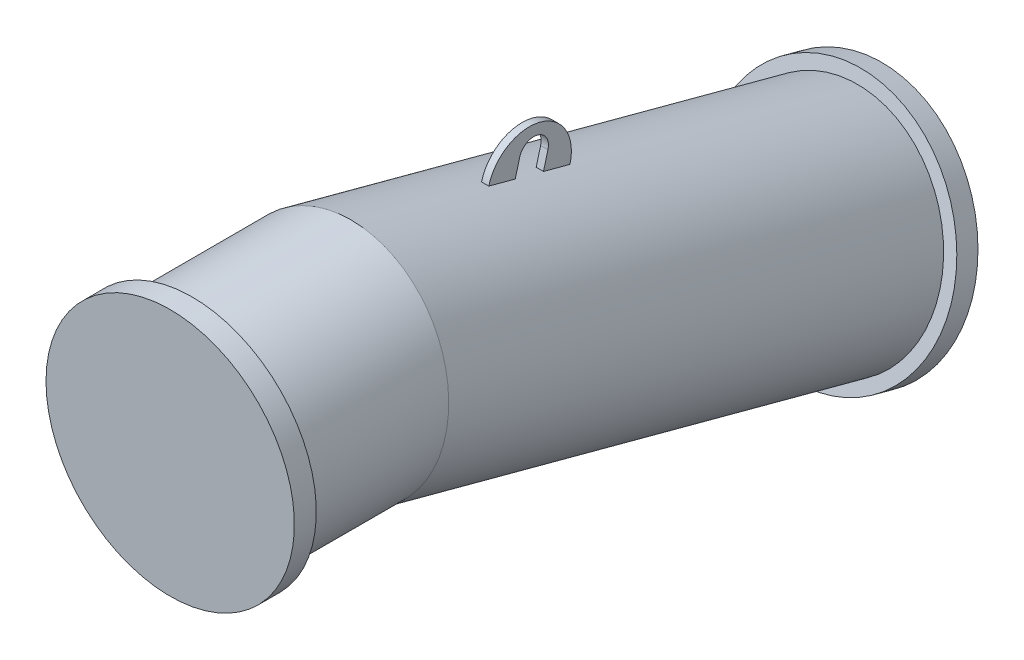
ISO-10303-21;
HEADER;
FILE_DESCRIPTION(('STEP AP214'),'2;1');
FILE_NAME('part.step','',(''),(''),'','','');
FILE_SCHEMA(('AUTOMOTIVE_DESIGN { 1 0 10303 214 1 1 1 1 }'));
ENDSEC;
DATA;
#1=APPLICATION_CONTEXT('core data for automotive mechanical design processes');
#2=APPLICATION_PROTOCOL_DEFINITION('international standard','automotive_design',2000,#1);
#3=PRODUCT_CONTEXT('',#1,'mechanical');
#4=PRODUCT('Part','Part','',(#3));
#5=PRODUCT_RELATED_PRODUCT_CATEGORY('part','',(#4));
#6=PRODUCT_DEFINITION_FORMATION('','',#4);
#7=PRODUCT_DEFINITION_CONTEXT('part definition',#1,'design');
#8=PRODUCT_DEFINITION('design','',#6,#7);
#9=PRODUCT_DEFINITION_SHAPE('','',#8);
#10=(LENGTH_UNIT() NAMED_UNIT(*) SI_UNIT(.MILLI.,.METRE.));
#11=(NAMED_UNIT(*) PLANE_ANGLE_UNIT() SI_UNIT($,.RADIAN.));
#12=(NAMED_UNIT(*) SI_UNIT($,.STERADIAN.) SOLID_ANGLE_UNIT());
#13=UNCERTAINTY_MEASURE_WITH_UNIT(LENGTH_MEASURE(1.E-05),#10,'distance_accuracy_value','');
#14=(GEOMETRIC_REPRESENTATION_CONTEXT(3) GLOBAL_UNCERTAINTY_ASSIGNED_CONTEXT((#13)) GLOBAL_UNIT_ASSIGNED_CONTEXT((#10,
#11,#12)) REPRESENTATION_CONTEXT('',''));
#15=CARTESIAN_POINT('',(0.,0.,0.));
#16=DIRECTION('',(0.,0.,1.));
#17=DIRECTION('',(1.,0.,0.));
#18=AXIS2_PLACEMENT_3D('',#15,#16,#17);
#19=CARTESIAN_POINT('',(0.,0.,-197.478746381094));
#20=DIRECTION('',(0.,0.,1.));
#21=DIRECTION('',(1.,0.,0.));
#22=AXIS2_PLACEMENT_3D('',#19,#20,#21);
#23=CYLINDRICAL_SURFACE('',#22,152.5);
#24=CARTESIAN_POINT('',(0.,0.,0.));
#25=DIRECTION('',(0.,0.,-1.));
#26=DIRECTION('',(-1.,0.,0.));
#27=AXIS2_PLACEMENT_3D('',#24,#25,#26);
#28=CIRCLE('',#27,152.5);
#29=CARTESIAN_POINT('',(-152.5,0.,0.));
#30=VERTEX_POINT('',#29);
#31=EDGE_CURVE('E250',#30,#30,#28,.T.);
#32=ORIENTED_EDGE('',*,*,#31,.T.);
#33=EDGE_LOOP('',(#32));
#34=FACE_BOUND('',#33,.T.);
#35=CARTESIAN_POINT('',(-1.06015028636744E-13,1.11022302462516E-13,-197.478746381094));
#36=DIRECTION('',(0.,0.130526192220051,0.99144486137381));
#37=DIRECTION('',(0.,0.99144486137381,-0.130526192220051));
#38=AXIS2_PLACEMENT_3D('',#35,#36,#37);
#39=ELLIPSE('',#38,153.815916488473,152.5);
#40=CARTESIAN_POINT('',(-1.084304603301E-13,152.5,-217.555752263171));
#41=VERTEX_POINT('',#40);
#42=EDGE_CURVE('E261',#41,#41,#39,.T.);
#43=ORIENTED_EDGE('',*,*,#42,.T.);
#44=EDGE_LOOP('',(#43));
#45=FACE_BOUND('',#44,.T.);
#46=ADVANCED_FACE('F17',(#34,#45),#23,.T.);
#47=CARTESIAN_POINT('',(0.,-6.66966482043563E-13,1.56125112837913E-13));
#48=DIRECTION('',(0.,0.,1.00000000000001));
#49=DIRECTION('',(-1.,0.,0.));
#50=AXIS2_PLACEMENT_3D('',#47,#48,#49);
#51=CYLINDRICAL_SURFACE('',#50,170.);
#52=CARTESIAN_POINT('',(0.,-6.66966482043563E-13,1.56125112837913E-13));
#53=DIRECTION('',(0.,0.,1.00000000000001));
#54=DIRECTION('',(-1.,0.,0.));
#55=AXIS2_PLACEMENT_3D('',#52,#53,#54);
#56=CIRCLE('',#55,170.);
#57=CARTESIAN_POINT('',(-170.,-6.14080048112524E-13,0.));
#58=VERTEX_POINT('',#57);
#59=EDGE_CURVE('E246',#58,#58,#56,.T.);
#60=ORIENTED_EDGE('',*,*,#59,.T.);
#61=EDGE_LOOP('',(#60));
#62=FACE_BOUND('',#61,.T.);
#63=CARTESIAN_POINT('',(0.,0.,30.));
#64=DIRECTION('',(0.,0.,1.00000000000001));
#65=DIRECTION('',(-1.,0.,0.));
#66=AXIS2_PLACEMENT_3D('',#63,#64,#65);
#67=CIRCLE('',#66,170.);
#68=CARTESIAN_POINT('',(-170.,0.,29.9999999999999));
#69=VERTEX_POINT('',#68);
#70=EDGE_CURVE('E244',#69,#69,#67,.T.);
#71=ORIENTED_EDGE('',*,*,#70,.F.);
#72=EDGE_LOOP('',(#71));
#73=FACE_BOUND('',#72,.T.);
#74=ADVANCED_FACE('F521',(#62,#73),#51,.T.);
#75=CARTESIAN_POINT('',(0.,-6.66966482043563E-13,1.56125112837913E-13));
#76=DIRECTION('',(0.,0.,1.00000000000001));
#77=DIRECTION('',(-1.,0.,0.));
#78=AXIS2_PLACEMENT_3D('',#75,#76,#77);
#79=PLANE('',#78);
#80=ORIENTED_EDGE('',*,*,#31,.F.);
#81=EDGE_LOOP('',(#80));
#82=FACE_BOUND('',#81,.T.);
#83=ORIENTED_EDGE('',*,*,#59,.F.);
#84=EDGE_LOOP('',(#83));
#85=FACE_BOUND('',#84,.T.);
#86=ADVANCED_FACE('F996',(#82,#85),#79,.F.);
#87=CARTESIAN_POINT('',(0.,-180.520783117658,-871.19148079832));
#88=DIRECTION('',(0.,-0.258819045102523,-0.965925826289074));
#89=DIRECTION('',(-1.,0.,0.));
#90=AXIS2_PLACEMENT_3D('',#87,#88,#89);
#91=CYLINDRICAL_SURFACE('',#90,170.);
#92=CARTESIAN_POINT('',(0.,-180.520783117658,-871.19148079832));
#93=DIRECTION('',(0.,-0.258819045102523,-0.965925826289074));
#94=DIRECTION('',(-1.,0.,0.));
#95=AXIS2_PLACEMENT_3D('',#92,#93,#94);
#96=CIRCLE('',#95,170.);
#97=CARTESIAN_POINT('',(-170.,-180.520783117658,-871.19148079832));
#98=VERTEX_POINT('',#97);
#99=EDGE_CURVE('E176',#98,#98,#96,.T.);
#100=ORIENTED_EDGE('',*,*,#99,.T.);
#101=EDGE_LOOP('',(#100));
#102=FACE_BOUND('',#101,.T.);
#103=CARTESIAN_POINT('',(0.,-188.285354470734,-900.169255586992));
#104=DIRECTION('',(0.,-0.258819045102523,-0.965925826289074));
#105=DIRECTION('',(-1.,0.,0.));
#106=AXIS2_PLACEMENT_3D('',#103,#104,#105);
#107=CIRCLE('',#106,170.);
#108=CARTESIAN_POINT('',(-170.,-188.285354470734,-900.169255586992));
#109=VERTEX_POINT('',#108);
#110=EDGE_CURVE('E166',#109,#109,#107,.T.);
#111=ORIENTED_EDGE('',*,*,#110,.F.);
#112=EDGE_LOOP('',(#111));
#113=FACE_BOUND('',#112,.T.);
#114=ADVANCED_FACE('F988',(#102,#113),#91,.T.);
#115=CARTESIAN_POINT('',(0.,-180.520783117658,-871.19148079832));
#116=DIRECTION('',(0.,-0.258819045102523,-0.965925826289074));
#117=DIRECTION('',(-1.,0.,0.));
#118=AXIS2_PLACEMENT_3D('',#115,#116,#117);
#119=PLANE('',#118);
#120=CARTESIAN_POINT('',(-1.07213052614488E-13,-180.520783117658,-871.191480798316));
#121=DIRECTION('',(0.,-0.25881904510252,-0.965925826289068));
#122=DIRECTION('',(-1.,0.,0.));
#123=AXIS2_PLACEMENT_3D('',#120,#121,#122);
#124=CIRCLE('',#123,152.5);
#125=CARTESIAN_POINT('',(-152.5,-180.520783117658,-871.191480798316));
#126=VERTEX_POINT('',#125);
#127=EDGE_CURVE('E257',#126,#126,#124,.T.);
#128=ORIENTED_EDGE('',*,*,#127,.T.);
#129=EDGE_LOOP('',(#128));
#130=FACE_BOUND('',#129,.T.);
#131=ORIENTED_EDGE('',*,*,#99,.F.);
#132=EDGE_LOOP('',(#131));
#133=FACE_BOUND('',#132,.T.);
#134=ADVANCED_FACE('F285',(#130,#133),#119,.F.);
#135=CARTESIAN_POINT('',(-1.07213052614488E-13,-180.520783117658,-871.191480798316));
#136=DIRECTION('',(0.,0.25881904510252,0.965925826289068));
#137=DIRECTION('',(0.,-0.965925826289068,0.25881904510252));
#138=AXIS2_PLACEMENT_3D('',#135,#136,#137);
#139=CYLINDRICAL_SURFACE('',#138,152.5);
#140=DIRECTION('',(0.,0.25881904510252,0.965925826289068));
#141=VECTOR('',#140,1.);
#142=CARTESIAN_POINT('',(5.00000000000003,-33.2962901457557,-910.640164796218));
#143=LINE('',#142,#141);
#144=CARTESIAN_POINT('',(5.,103.230741016744,-401.114347891228));
#145=VERTEX_POINT('',#144);
#146=CARTESIAN_POINT('',(5.00000000000002,93.5250419544781,-437.336509914578));
#147=VERTEX_POINT('',#146);
#148=EDGE_CURVE('E300',#145,#147,#143,.F.);
#149=ORIENTED_EDGE('',*,*,#148,.F.);
#150=CARTESIAN_POINT('',(5.,103.230741016744,-401.114347891228));
#151=CARTESIAN_POINT('',(3.33333333333334,103.283548127584,-401.128457169723));
#152=CARTESIAN_POINT('',(1.66666666666668,103.309951683004,-401.135511808971));
#153=CARTESIAN_POINT('',(-1.66666666666664,103.309951683004,-401.135511808971));
#154=CARTESIAN_POINT('',(-3.33333333333329,103.283548127584,-401.128457169723));
#155=CARTESIAN_POINT('',(-4.99999999999995,103.230741016744,-401.114347891228));
#156=B_SPLINE_CURVE_WITH_KNOTS('',3,(#150,#151,#152,#153,#154,#155),.UNSPECIFIED.,.F.,.F.,(4,2,
4),(0.,5.00067217892387,10.0013443578477),.UNSPECIFIED.);
#157=CARTESIAN_POINT('',(-4.99999999999998,103.230741016744,-401.114347891228));
#158=VERTEX_POINT('',#157);
#159=EDGE_CURVE('E39',#145,#158,#156,.T.);
#160=ORIENTED_EDGE('',*,*,#159,.T.);
#161=DIRECTION('',(0.,0.25881904510252,0.965925826289068));
#162=VECTOR('',#161,1.);
#163=CARTESIAN_POINT('',(-4.99999999999993,-33.2962901457557,-910.640164796218));
#164=LINE('',#163,#162);
#165=CARTESIAN_POINT('',(-4.99999999999995,93.5250419544779,-437.336509914579));
#166=VERTEX_POINT('',#165);
#167=EDGE_CURVE('E10',#158,#166,#164,.F.);
#168=ORIENTED_EDGE('',*,*,#167,.T.);
#169=CARTESIAN_POINT('',(-1.06371404389162E-13,-53.6994510174235,-397.887825916675));
#170=DIRECTION('',(0.,0.258819045102521,0.965925826289068));
#171=DIRECTION('',(0.,-0.965925826289068,0.258819045102521));
#172=AXIS2_PLACEMENT_3D('',#169,#170,#171);
#173=CIRCLE('',#172,152.5);
#174=EDGE_CURVE('E296',#166,#147,#173,.F.);
#175=ORIENTED_EDGE('',*,*,#174,.T.);
#176=EDGE_LOOP('',(#149,#160,#168,#175));
#177=FACE_BOUND('',#176,.T.);
#178=CARTESIAN_POINT('',(5.00000000000002,83.1722801503773,-475.973542966141));
#179=VERTEX_POINT('',#178);
#180=CARTESIAN_POINT('',(5.,73.4665810881111,-512.195704989492));
#181=VERTEX_POINT('',#180);
#182=EDGE_CURVE('E50',#179,#181,#143,.F.);
#183=ORIENTED_EDGE('',*,*,#182,.F.);
#184=CARTESIAN_POINT('',(-1.0644011036674E-13,-64.0522128215244,-436.524858968238));
#185=DIRECTION('',(0.,-0.258819045102521,-0.965925826289068));
#186=DIRECTION('',(0.,0.965925826289068,-0.258819045102521));
#187=AXIS2_PLACEMENT_3D('',#184,#185,#186);
#188=CIRCLE('',#187,152.5);
#189=CARTESIAN_POINT('',(-4.99999999999995,83.1722801503771,-475.973542966142));
#190=VERTEX_POINT('',#189);
#191=EDGE_CURVE('E274',#179,#190,#188,.F.);
#192=ORIENTED_EDGE('',*,*,#191,.T.);
#193=CARTESIAN_POINT('',(-4.99999999999998,73.4665810881111,-512.195704989492));
#194=VERTEX_POINT('',#193);
#195=EDGE_CURVE('E21',#190,#194,#164,.F.);
#196=ORIENTED_EDGE('',*,*,#195,.T.);
#197=CARTESIAN_POINT('',(-4.99999999999995,73.4665810881113,-512.195704989492));
#198=CARTESIAN_POINT('',(-3.33333333333329,73.5193680268464,-512.209889551307));
#199=CARTESIAN_POINT('',(-1.66666666666664,73.5457614962138,-512.216981832213));
#200=CARTESIAN_POINT('',(1.66666666666668,73.5457614962138,-512.216981832213));
#201=CARTESIAN_POINT('',(3.33333333333334,73.5193680268463,-512.209889551307));
#202=CARTESIAN_POINT('',(5.,73.4665810881113,-512.195704989492));
#203=B_SPLINE_CURVE_WITH_KNOTS('',3,(#197,#198,#199,#200,#201,#202),.UNSPECIFIED.,.F.,.F.,(4,2,
4),(0.,5.00067217892387,10.0013443578477),.UNSPECIFIED.);
#204=EDGE_CURVE('E265',#194,#181,#203,.T.);
#205=ORIENTED_EDGE('',*,*,#204,.T.);
#206=EDGE_LOOP('',(#183,#192,#196,#205));
#207=FACE_BOUND('',#206,.T.);
#208=ORIENTED_EDGE('',*,*,#127,.F.);
#209=EDGE_LOOP('',(#208));
#210=FACE_BOUND('',#209,.T.);
#211=ORIENTED_EDGE('',*,*,#42,.F.);
#212=EDGE_LOOP('',(#211));
#213=FACE_BOUND('',#212,.T.);
#214=ADVANCED_FACE('F280',(#177,#207,#210,#213),#139,.T.);
#215=CARTESIAN_POINT('',(5.,88.4278565896092,-456.676246820592));
#216=DIRECTION('',(-0.999999999999999,0.,0.));
#217=DIRECTION('',(0.,-0.965925826289069,0.258819045102521));
#218=AXIS2_PLACEMENT_3D('',#215,#216,#217);
#219=CYLINDRICAL_SURFACE('',#218,57.5);
#220=ORIENTED_EDGE('',*,*,#159,.F.);
#221=CARTESIAN_POINT('',(5.,88.4278565896092,-456.676246820592));
#222=DIRECTION('',(0.999999999999999,0.,0.));
#223=DIRECTION('',(0.,0.965925826289069,-0.258819045102521));
#224=AXIS2_PLACEMENT_3D('',#221,#222,#223);
#225=CIRCLE('',#224,57.5);
#226=EDGE_CURVE('E311',#181,#145,#225,.T.);
#227=ORIENTED_EDGE('',*,*,#226,.F.);
#228=ORIENTED_EDGE('',*,*,#204,.F.);
#229=CARTESIAN_POINT('',(-4.99999999999998,88.4278565896092,-456.676246820592));
#230=DIRECTION('',(0.999999999999999,0.,0.));
#231=DIRECTION('',(0.,0.965925826289069,-0.258819045102521));
#232=AXIS2_PLACEMENT_3D('',#229,#230,#231);
#233=CIRCLE('',#232,57.5);
#234=EDGE_CURVE('E305',#194,#158,#233,.T.);
#235=ORIENTED_EDGE('',*,*,#234,.T.);
#236=EDGE_LOOP('',(#220,#227,#228,#235));
#237=FACE_BOUND('',#236,.T.);
#238=ADVANCED_FACE('F276',(#237),#219,.T.);
#239=CARTESIAN_POINT('',(5.,111.127113507403,-462.758494380501));
#240=DIRECTION('',(0.999999999999999,0.,0.));
#241=DIRECTION('',(0.,0.965925826289069,-0.258819045102521));
#242=AXIS2_PLACEMENT_3D('',#239,#240,#241);
#243=PLANE('',#242);
#244=ORIENTED_EDGE('',*,*,#226,.T.);
#245=ORIENTED_EDGE('',*,*,#148,.T.);
#246=DIRECTION('',(0.,0.965925826289069,-0.258819045102521));
#247=VECTOR('',#246,1.);
#248=CARTESIAN_POINT('',(5.00000000000001,93.6042374916589,-437.35773029481));
#249=LINE('',#248,#247);
#250=CARTESIAN_POINT('',(5.00000000000001,116.303494409453,-443.439977854719));
#251=VERTEX_POINT('',#250);
#252=EDGE_CURVE('E301',#147,#251,#249,.T.);
#253=ORIENTED_EDGE('',*,*,#252,.T.);
#254=CARTESIAN_POINT('',(5.,111.127113507403,-462.758494380501));
#255=DIRECTION('',(-0.999999999999999,0.,0.));
#256=DIRECTION('',(0.,0.965925826289069,-0.258819045102521));
#257=AXIS2_PLACEMENT_3D('',#254,#255,#256);
#258=CIRCLE('',#257,20.);
#259=CARTESIAN_POINT('',(5.00000000000001,105.950732605352,-482.077010906282));
#260=VERTEX_POINT('',#259);
#261=EDGE_CURVE('E304',#251,#260,#258,.T.);
#262=ORIENTED_EDGE('',*,*,#261,.T.);
#263=DIRECTION('',(0.,-0.965925826289069,0.258819045102521));
#264=VECTOR('',#263,1.);
#265=CARTESIAN_POINT('',(5.00000000000001,83.2514756875585,-475.994763346373));
#266=LINE('',#265,#264);
#267=EDGE_CURVE('E308',#260,#179,#266,.T.);
#268=ORIENTED_EDGE('',*,*,#267,.T.);
#269=ORIENTED_EDGE('',*,*,#182,.T.);
#270=EDGE_LOOP('',(#244,#245,#253,#262,#268,#269));
#271=FACE_BOUND('',#270,.T.);
#272=ADVANCED_FACE('F288',(#271),#243,.T.);
#273=CARTESIAN_POINT('',(-4.99999999999998,111.127113507403,-462.758494380501));
#274=DIRECTION('',(0.999999999999999,0.,0.));
#275=DIRECTION('',(0.,0.965925826289069,-0.258819045102521));
#276=AXIS2_PLACEMENT_3D('',#273,#274,#275);
#277=PLANE('',#276);
#278=ORIENTED_EDGE('',*,*,#167,.F.);
#279=ORIENTED_EDGE('',*,*,#234,.F.);
#280=ORIENTED_EDGE('',*,*,#195,.F.);
#281=DIRECTION('',(0.,-0.965925826289069,0.258819045102521));
#282=VECTOR('',#281,1.);
#283=CARTESIAN_POINT('',(-4.99999999999998,83.2514756875582,-475.994763346373));
#284=LINE('',#283,#282);
#285=CARTESIAN_POINT('',(-4.99999999999997,105.950732605352,-482.077010906282));
#286=VERTEX_POINT('',#285);
#287=EDGE_CURVE('E321',#286,#190,#284,.T.);
#288=ORIENTED_EDGE('',*,*,#287,.F.);
#289=CARTESIAN_POINT('',(-4.99999999999998,111.127113507403,-462.758494380501));
#290=DIRECTION('',(-0.999999999999999,0.,0.));
#291=DIRECTION('',(0.,0.965925826289069,-0.258819045102521));
#292=AXIS2_PLACEMENT_3D('',#289,#290,#291);
#293=CIRCLE('',#292,20.);
#294=CARTESIAN_POINT('',(-4.99999999999998,116.303494409453,-443.439977854719));
#295=VERTEX_POINT('',#294);
#296=EDGE_CURVE('E318',#295,#286,#293,.T.);
#297=ORIENTED_EDGE('',*,*,#296,.F.);
#298=DIRECTION('',(0.,0.965925826289069,-0.258819045102521));
#299=VECTOR('',#298,1.);
#300=CARTESIAN_POINT('',(-4.99999999999997,93.6042374916592,-437.357730294811));
#301=LINE('',#300,#299);
#302=EDGE_CURVE('E315',#166,#295,#301,.T.);
#303=ORIENTED_EDGE('',*,*,#302,.F.);
#304=EDGE_LOOP('',(#278,#279,#280,#288,#297,#303));
#305=FACE_BOUND('',#304,.T.);
#306=ADVANCED_FACE('F349',(#305),#277,.F.);
#307=CARTESIAN_POINT('',(5.00000000000001,93.6042374916589,-437.35773029481));
#308=DIRECTION('',(0.,0.258819045102521,0.965925826289068));
#309=DIRECTION('',(0.,-0.965925826289069,0.258819045102521));
#310=AXIS2_PLACEMENT_3D('',#307,#308,#309);
#311=PLANE('',#310);
#312=ORIENTED_EDGE('',*,*,#174,.F.);
#313=ORIENTED_EDGE('',*,*,#302,.T.);
#314=DIRECTION('',(-0.999999999999999,0.,0.));
#315=VECTOR('',#314,1.);
#316=CARTESIAN_POINT('',(5.00000000000001,116.303494409453,-443.439977854719));
#317=LINE('',#316,#315);
#318=EDGE_CURVE('E329',#251,#295,#317,.T.);
#319=ORIENTED_EDGE('',*,*,#318,.F.);
#320=ORIENTED_EDGE('',*,*,#252,.F.);
#321=EDGE_LOOP('',(#312,#313,#319,#320));
#322=FACE_BOUND('',#321,.T.);
#323=ADVANCED_FACE('F19',(#322),#311,.F.);
#324=CARTESIAN_POINT('',(5.,111.127113507403,-462.758494380501));
#325=DIRECTION('',(-0.999999999999999,0.,0.));
#326=DIRECTION('',(0.,-0.965925826289069,0.258819045102521));
#327=AXIS2_PLACEMENT_3D('',#324,#325,#326);
#328=CYLINDRICAL_SURFACE('',#327,20.);
#329=ORIENTED_EDGE('',*,*,#296,.T.);
#330=DIRECTION('',(-0.999999999999999,0.,0.));
#331=VECTOR('',#330,1.);
#332=CARTESIAN_POINT('',(5.00000000000001,105.950732605352,-482.077010906282));
#333=LINE('',#332,#331);
#334=EDGE_CURVE('E314',#260,#286,#333,.T.);
#335=ORIENTED_EDGE('',*,*,#334,.F.);
#336=ORIENTED_EDGE('',*,*,#261,.F.);
#337=ORIENTED_EDGE('',*,*,#318,.T.);
#338=EDGE_LOOP('',(#329,#335,#336,#337));
#339=FACE_BOUND('',#338,.T.);
#340=ADVANCED_FACE('F354',(#339),#328,.F.);
#341=CARTESIAN_POINT('',(5.00000000000001,83.2514756875585,-475.994763346373));
#342=DIRECTION('',(0.,-0.258819045102521,-0.965925826289068));
#343=DIRECTION('',(0.,0.965925826289069,-0.258819045102521));
#344=AXIS2_PLACEMENT_3D('',#341,#342,#343);
#345=PLANE('',#344);
#346=ORIENTED_EDGE('',*,*,#191,.F.);
#347=ORIENTED_EDGE('',*,*,#267,.F.);
#348=ORIENTED_EDGE('',*,*,#334,.T.);
#349=ORIENTED_EDGE('',*,*,#287,.T.);
#350=EDGE_LOOP('',(#346,#347,#348,#349));
#351=FACE_BOUND('',#350,.T.);
#352=ADVANCED_FACE('F351',(#351),#345,.F.);
#353=CARTESIAN_POINT('',(0.,0.,30.));
#354=DIRECTION('',(0.,0.,1.00000000000001));
#355=DIRECTION('',(-1.,0.,0.));
#356=AXIS2_PLACEMENT_3D('',#353,#354,#355);
#357=PLANE('',#356);
#358=ORIENTED_EDGE('',*,*,#70,.T.);
#359=EDGE_LOOP('',(#358));
#360=FACE_BOUND('',#359,.T.);
#361=ADVANCED_FACE('F860',(#360),#357,.T.);
#362=CARTESIAN_POINT('',(0.,-188.285354470734,-900.169255586992));
#363=DIRECTION('',(0.,-0.258819045102523,-0.965925826289074));
#364=DIRECTION('',(-1.,0.,0.));
#365=AXIS2_PLACEMENT_3D('',#362,#363,#364);
#366=PLANE('',#365);
#367=ORIENTED_EDGE('',*,*,#110,.T.);
#368=EDGE_LOOP('',(#367));
#369=FACE_BOUND('',#368,.T.);
#370=ADVANCED_FACE('F952',(#369),#366,.T.);
#371=CLOSED_SHELL('',(#46,#74,#86,#114,#134,#214,#238,#272,#306,#323,#340,#352,#361,#370));
#372=CARTESIAN_POINT('',(136.272231045415,-236.337340408793,-861.411860249925));
#373=DIRECTION('',(0.,-0.258819045102521,-0.965925826289068));
#374=DIRECTION('',(0.,0.965925826289068,-0.258819045102521));
#375=AXIS2_PLACEMENT_3D('',#372,#373,#374);
#376=PLANE('',#375);
#377=CARTESIAN_POINT('',(136.272231045415,-236.337340408793,-861.411860249925));
#378=DIRECTION('',(0.,-0.258819045102521,-0.965925826289068));
#379=DIRECTION('',(0.,0.965925826289068,-0.258819045102521));
#380=AXIS2_PLACEMENT_3D('',#377,#378,#379);
#381=CIRCLE('',#380,6.25358077647383);
#382=CARTESIAN_POINT('',(136.272231045415,-230.296845230012,-863.030406054964));
#383=VERTEX_POINT('',#382);
#384=EDGE_CURVE('E163',#383,#383,#381,.F.);
#385=ORIENTED_EDGE('',*,*,#384,.T.);
#386=EDGE_LOOP('',(#385));
#387=FACE_BOUND('',#386,.T.);
#388=ADVANCED_FACE('F158',(#387),#376,.F.);
#389=CARTESIAN_POINT('',(136.272231045415,-236.725568976447,-862.860748989359));
#390=DIRECTION('',(0.,-0.258819045102523,-0.965925826289074));
#391=DIRECTION('',(-1.,0.,0.));
#392=AXIS2_PLACEMENT_3D('',#389,#390,#391);
#393=CONICAL_SURFACE('',#392,8.74999999999999,1.02974425867665);
#394=CARTESIAN_POINT('',(136.272231045415,-235.364819974453,-857.782364577571));
#395=VERTEX_POINT('',#394);
#396=VERTEX_LOOP('',#395);
#397=FACE_BOUND('',#396,.T.);
#398=ORIENTED_EDGE('',*,*,#384,.F.);
#399=EDGE_LOOP('',(#398));
#400=FACE_BOUND('',#399,.T.);
#401=ADVANCED_FACE('F155',(#397,#400),#393,.F.);
#402=CLOSED_SHELL('',(#388,#401));
#403=CARTESIAN_POINT('',(136.272231045415,-127.292416277549,-890.630359609605));
#404=DIRECTION('',(0.,-0.258819045102521,-0.965925826289068));
#405=DIRECTION('',(0.,0.965925826289068,-0.258819045102521));
#406=AXIS2_PLACEMENT_3D('',#403,#404,#405);
#407=PLANE('',#406);
#408=CARTESIAN_POINT('',(136.272231045415,-127.292416277548,-890.630359609606));
#409=DIRECTION('',(0.,-0.258819045102521,-0.965925826289068));
#410=DIRECTION('',(0.,0.965925826289068,-0.258819045102521));
#411=AXIS2_PLACEMENT_3D('',#408,#409,#410);
#412=CIRCLE('',#411,6.2535807764741);
#413=CARTESIAN_POINT('',(136.272231045415,-121.251921098767,-892.248905414644));
#414=VERTEX_POINT('',#413);
#415=EDGE_CURVE('E167',#414,#414,#412,.F.);
#416=ORIENTED_EDGE('',*,*,#415,.T.);
#417=EDGE_LOOP('',(#416));
#418=FACE_BOUND('',#417,.T.);
#419=ADVANCED_FACE('F799',(#418),#407,.F.);
#420=CARTESIAN_POINT('',(136.272231045415,-127.680644845202,-892.079248349039));
#421=DIRECTION('',(0.,-0.258819045102523,-0.965925826289074));
#422=DIRECTION('',(-1.,0.,0.));
#423=AXIS2_PLACEMENT_3D('',#420,#421,#422);
#424=CONICAL_SURFACE('',#423,8.74999999999999,1.02974425867665);
#425=CARTESIAN_POINT('',(136.272231045415,-126.319895843208,-887.00086393725));
#426=VERTEX_POINT('',#425);
#427=VERTEX_LOOP('',#426);
#428=FACE_BOUND('',#427,.T.);
#429=ORIENTED_EDGE('',*,*,#415,.F.);
#430=EDGE_LOOP('',(#429));
#431=FACE_BOUND('',#430,.T.);
#432=ADVANCED_FACE('F803',(#428,#431),#424,.F.);
#433=CLOSED_SHELL('',(#419,#432));
#434=CARTESIAN_POINT('',(56.445806273851,-50.1860109703731,-911.29095864293));
#435=DIRECTION('',(0.,-0.258819045102521,-0.965925826289068));
#436=DIRECTION('',(0.,0.965925826289068,-0.258819045102521));
#437=AXIS2_PLACEMENT_3D('',#434,#435,#436);
#438=PLANE('',#437);
#439=CARTESIAN_POINT('',(56.445806273851,-50.186010970372,-911.29095864293));
#440=DIRECTION('',(0.,-0.258819045102521,-0.965925826289068));
#441=DIRECTION('',(0.,0.965925826289068,-0.258819045102521));
#442=AXIS2_PLACEMENT_3D('',#439,#440,#441);
#443=CIRCLE('',#442,6.25358077647497);
#444=CARTESIAN_POINT('',(56.445806273851,-44.14551579159,-912.909504447969));
#445=VERTEX_POINT('',#444);
#446=EDGE_CURVE('E180',#445,#445,#443,.F.);
#447=ORIENTED_EDGE('',*,*,#446,.T.);
#448=EDGE_LOOP('',(#447));
#449=FACE_BOUND('',#448,.T.);
#450=ADVANCED_FACE('F661',(#449),#438,.F.);
#451=CARTESIAN_POINT('',(56.445806273851,-50.5742395380257,-912.739847382363));
#452=DIRECTION('',(0.,-0.258819045102523,-0.965925826289074));
#453=DIRECTION('',(-1.,0.,0.));
#454=AXIS2_PLACEMENT_3D('',#451,#452,#453);
#455=CONICAL_SURFACE('',#454,8.75000000000001,1.02974425867665);
#456=CARTESIAN_POINT('',(56.445806273851,-49.2134905360328,-907.661462970575));
#457=VERTEX_POINT('',#456);
#458=VERTEX_LOOP('',#457);
#459=FACE_BOUND('',#458,.T.);
#460=ORIENTED_EDGE('',*,*,#446,.F.);
#461=EDGE_LOOP('',(#460));
#462=FACE_BOUND('',#461,.T.);
#463=ADVANCED_FACE('F666',(#459,#462),#455,.F.);
#464=CLOSED_SHELL('',(#450,#463));
#465=CARTESIAN_POINT('',(56.44580627385,-313.443745715969,-840.751261216601));
#466=DIRECTION('',(0.,-0.258819045102521,-0.965925826289068));
#467=DIRECTION('',(0.,0.965925826289068,-0.258819045102521));
#468=AXIS2_PLACEMENT_3D('',#465,#466,#467);
#469=PLANE('',#468);
#470=CARTESIAN_POINT('',(56.44580627385,-313.443745715968,-840.751261216601));
#471=DIRECTION('',(0.,-0.258819045102521,-0.965925826289068));
#472=DIRECTION('',(0.,0.965925826289068,-0.258819045102521));
#473=AXIS2_PLACEMENT_3D('',#470,#471,#472);
#474=CIRCLE('',#473,6.25358077647461);
#475=CARTESIAN_POINT('',(56.44580627385,-307.403250537187,-842.369807021639));
#476=VERTEX_POINT('',#475);
#477=EDGE_CURVE('E189',#476,#476,#474,.F.);
#478=ORIENTED_EDGE('',*,*,#477,.T.);
#479=EDGE_LOOP('',(#478));
#480=FACE_BOUND('',#479,.T.);
#481=ADVANCED_FACE('F500',(#480),#469,.F.);
#482=CARTESIAN_POINT('',(56.44580627385,-313.831974283622,-842.200149956034));
#483=DIRECTION('',(0.,-0.258819045102523,-0.965925826289074));
#484=DIRECTION('',(-1.,0.,0.));
#485=AXIS2_PLACEMENT_3D('',#482,#483,#484);
#486=CONICAL_SURFACE('',#485,8.75000000000001,1.02974425867665);
#487=CARTESIAN_POINT('',(56.44580627385,-312.471225281629,-837.121765544245));
#488=VERTEX_POINT('',#487);
#489=VERTEX_LOOP('',#488);
#490=FACE_BOUND('',#489,.T.);
#491=ORIENTED_EDGE('',*,*,#477,.F.);
#492=EDGE_LOOP('',(#491));
#493=FACE_BOUND('',#492,.T.);
#494=ADVANCED_FACE('F505',(#490,#493),#486,.F.);
#495=CLOSED_SHELL('',(#481,#494));
#496=CARTESIAN_POINT('',(-56.4458062738519,-313.443745715968,-840.751261216601));
#497=DIRECTION('',(0.,-0.258819045102521,-0.965925826289068));
#498=DIRECTION('',(0.,0.965925826289068,-0.258819045102521));
#499=AXIS2_PLACEMENT_3D('',#496,#497,#498);
#500=PLANE('',#499);
#501=CARTESIAN_POINT('',(-56.4458062738519,-313.443745715968,-840.751261216601));
#502=DIRECTION('',(0.,-0.258819045102521,-0.965925826289068));
#503=DIRECTION('',(0.,0.965925826289068,-0.258819045102521));
#504=AXIS2_PLACEMENT_3D('',#501,#502,#503);
#505=CIRCLE('',#504,6.25358077647456);
#506=CARTESIAN_POINT('',(-56.4458062738519,-307.403250537186,-842.36980702164));
#507=VERTEX_POINT('',#506);
#508=EDGE_CURVE('E193',#507,#507,#505,.F.);
#509=ORIENTED_EDGE('',*,*,#508,.T.);
#510=EDGE_LOOP('',(#509));
#511=FACE_BOUND('',#510,.T.);
#512=ADVANCED_FACE('F578',(#511),#500,.F.);
#513=CARTESIAN_POINT('',(-56.4458062738519,-313.831974283621,-842.200149956034));
#514=DIRECTION('',(0.,-0.258819045102523,-0.965925826289074));
#515=DIRECTION('',(-1.,0.,0.));
#516=AXIS2_PLACEMENT_3D('',#513,#514,#515);
#517=CONICAL_SURFACE('',#516,8.75000000000001,1.02974425867665);
#518=CARTESIAN_POINT('',(-56.4458062738519,-312.471225281628,-837.121765544245));
#519=VERTEX_POINT('',#518);
#520=VERTEX_LOOP('',#519);
#521=FACE_BOUND('',#520,.T.);
#522=ORIENTED_EDGE('',*,*,#508,.F.);
#523=EDGE_LOOP('',(#522));
#524=FACE_BOUND('',#523,.T.);
#525=ADVANCED_FACE('F582',(#521,#524),#517,.F.);
#526=CLOSED_SHELL('',(#512,#525));
#527=CARTESIAN_POINT('',(-136.272231045415,-236.337340408792,-861.411860249926));
#528=DIRECTION('',(0.,-0.258819045102521,-0.965925826289068));
#529=DIRECTION('',(0.,0.965925826289068,-0.258819045102521));
#530=AXIS2_PLACEMENT_3D('',#527,#528,#529);
#531=PLANE('',#530);
#532=CARTESIAN_POINT('',(-136.272231045416,-236.337340408791,-861.411860249926));
#533=DIRECTION('',(0.,-0.258819045102521,-0.965925826289068));
#534=DIRECTION('',(0.,0.965925826289068,-0.258819045102521));
#535=AXIS2_PLACEMENT_3D('',#532,#533,#534);
#536=CIRCLE('',#535,6.25358077647273);
#537=CARTESIAN_POINT('',(-136.272231045416,-230.296845230011,-863.030406054964));
#538=VERTEX_POINT('',#537);
#539=EDGE_CURVE('E197',#538,#538,#536,.F.);
#540=ORIENTED_EDGE('',*,*,#539,.T.);
#541=EDGE_LOOP('',(#540));
#542=FACE_BOUND('',#541,.T.);
#543=ADVANCED_FACE('F598',(#542),#531,.F.);
#544=CARTESIAN_POINT('',(-136.272231045416,-236.725568976445,-862.86074898936));
#545=DIRECTION('',(0.,-0.258819045102523,-0.965925826289074));
#546=DIRECTION('',(-1.,0.,0.));
#547=AXIS2_PLACEMENT_3D('',#544,#545,#546);
#548=CONICAL_SURFACE('',#547,8.74999999999999,1.02974425867665);
#549=CARTESIAN_POINT('',(-136.272231045416,-235.364819974452,-857.782364577571));
#550=VERTEX_POINT('',#549);
#551=VERTEX_LOOP('',#550);
#552=FACE_BOUND('',#551,.T.);
#553=ORIENTED_EDGE('',*,*,#539,.F.);
#554=EDGE_LOOP('',(#553));
#555=FACE_BOUND('',#554,.T.);
#556=ADVANCED_FACE('F602',(#552,#555),#548,.F.);
#557=CLOSED_SHELL('',(#543,#556));
#558=CARTESIAN_POINT('',(-56.445806273849,-50.1860109703728,-911.29095864293));
#559=DIRECTION('',(0.,-0.258819045102521,-0.965925826289068));
#560=DIRECTION('',(0.,0.965925826289068,-0.258819045102521));
#561=AXIS2_PLACEMENT_3D('',#558,#559,#560);
#562=PLANE('',#561);
#563=CARTESIAN_POINT('',(-56.445806273849,-50.1860109703717,-911.29095864293));
#564=DIRECTION('',(0.,-0.258819045102521,-0.965925826289068));
#565=DIRECTION('',(0.,0.965925826289068,-0.258819045102521));
#566=AXIS2_PLACEMENT_3D('',#563,#564,#565);
#567=CIRCLE('',#566,6.2535807764744);
#568=CARTESIAN_POINT('',(-56.445806273849,-44.1455157915902,-912.909504447969));
#569=VERTEX_POINT('',#568);
#570=EDGE_CURVE('E201',#569,#569,#567,.F.);
#571=ORIENTED_EDGE('',*,*,#570,.T.);
#572=EDGE_LOOP('',(#571));
#573=FACE_BOUND('',#572,.T.);
#574=ADVANCED_FACE('F620',(#573),#562,.F.);
#575=CARTESIAN_POINT('',(-56.445806273849,-50.5742395380255,-912.739847382364));
#576=DIRECTION('',(0.,-0.258819045102523,-0.965925826289074));
#577=DIRECTION('',(-1.,0.,0.));
#578=AXIS2_PLACEMENT_3D('',#575,#576,#577);
#579=CONICAL_SURFACE('',#578,8.75000000000001,1.02974425867665);
#580=CARTESIAN_POINT('',(-56.445806273849,-49.2134905360322,-907.661462970575));
#581=VERTEX_POINT('',#580);
#582=VERTEX_LOOP('',#581);
#583=FACE_BOUND('',#582,.T.);
#584=ORIENTED_EDGE('',*,*,#570,.F.);
#585=EDGE_LOOP('',(#584));
#586=FACE_BOUND('',#585,.T.);
#587=ADVANCED_FACE('F624',(#583,#586),#579,.F.);
#588=CLOSED_SHELL('',(#574,#587));
#589=CARTESIAN_POINT('',(-136.272231045414,-127.292416277547,-890.630359609606));
#590=DIRECTION('',(0.,-0.258819045102521,-0.965925826289068));
#591=DIRECTION('',(0.,0.965925826289068,-0.258819045102521));
#592=AXIS2_PLACEMENT_3D('',#589,#590,#591);
#593=PLANE('',#592);
#594=CARTESIAN_POINT('',(-136.272231045414,-127.292416277546,-890.630359609606));
#595=DIRECTION('',(0.,-0.258819045102521,-0.965925826289068));
#596=DIRECTION('',(0.,0.965925826289068,-0.258819045102521));
#597=AXIS2_PLACEMENT_3D('',#594,#595,#596);
#598=CIRCLE('',#597,6.2535807764743);
#599=CARTESIAN_POINT('',(-136.272231045414,-121.251921098765,-892.248905414645));
#600=VERTEX_POINT('',#599);
#601=EDGE_CURVE('E205',#600,#600,#598,.F.);
#602=ORIENTED_EDGE('',*,*,#601,.T.);
#603=EDGE_LOOP('',(#602));
#604=FACE_BOUND('',#603,.T.);
#605=ADVANCED_FACE('F640',(#604),#593,.F.);
#606=CARTESIAN_POINT('',(-136.272231045414,-127.6806448452,-892.07924834904));
#607=DIRECTION('',(0.,-0.258819045102523,-0.965925826289074));
#608=DIRECTION('',(-1.,0.,0.));
#609=AXIS2_PLACEMENT_3D('',#606,#607,#608);
#610=CONICAL_SURFACE('',#609,8.75,1.02974425867665);
#611=CARTESIAN_POINT('',(-136.272231045414,-126.319895843207,-887.000863937251));
#612=VERTEX_POINT('',#611);
#613=VERTEX_LOOP('',#612);
#614=FACE_BOUND('',#613,.T.);
#615=ORIENTED_EDGE('',*,*,#601,.F.);
#616=EDGE_LOOP('',(#615));
#617=FACE_BOUND('',#616,.T.);
#618=ADVANCED_FACE('F643',(#614,#617),#610,.F.);
#619=CLOSED_SHELL('',(#605,#618));
#620=CARTESIAN_POINT('',(-136.272231045414,-56.4458062738525,4.99999999999998));
#621=DIRECTION('',(0.,0.,1.));
#622=DIRECTION('',(1.,0.,0.));
#623=AXIS2_PLACEMENT_3D('',#620,#621,#622);
#624=PLANE('',#623);
#625=CARTESIAN_POINT('',(-136.272231045414,-56.4458062738538,4.99999999999998));
#626=DIRECTION('',(0.,0.,1.));
#627=DIRECTION('',(1.,0.,0.));
#628=AXIS2_PLACEMENT_3D('',#625,#626,#627);
#629=CIRCLE('',#628,6.25358077647407);
#630=CARTESIAN_POINT('',(-130.01865026894,-56.4458062738538,4.99999999999998));
#631=VERTEX_POINT('',#630);
#632=EDGE_CURVE('E223',#631,#631,#629,.F.);
#633=ORIENTED_EDGE('',*,*,#632,.T.);
#634=EDGE_LOOP('',(#633));
#635=FACE_BOUND('',#634,.T.);
#636=ADVANCED_FACE('F441',(#635),#624,.F.);
#637=CARTESIAN_POINT('',(-136.272231045414,-56.4458062738538,6.50000000000011));
#638=DIRECTION('',(0.,0.,1.00000000000001));
#639=DIRECTION('',(-1.,0.,0.));
#640=AXIS2_PLACEMENT_3D('',#637,#638,#639);
#641=CONICAL_SURFACE('',#640,8.75,1.02974425867665);
#642=CARTESIAN_POINT('',(-136.272231045414,-56.4458062738529,1.2424695835092));
#643=VERTEX_POINT('',#642);
#644=VERTEX_LOOP('',#643);
#645=FACE_BOUND('',#644,.T.);
#646=ORIENTED_EDGE('',*,*,#632,.F.);
#647=EDGE_LOOP('',(#646));
#648=FACE_BOUND('',#647,.T.);
#649=ADVANCED_FACE('F445',(#645,#648),#641,.F.);
#650=CLOSED_SHELL('',(#636,#649));
#651=CARTESIAN_POINT('',(-136.272231045415,56.4458062738497,4.99999999999998));
#652=DIRECTION('',(0.,0.,1.));
#653=DIRECTION('',(1.,0.,0.));
#654=AXIS2_PLACEMENT_3D('',#651,#652,#653);
#655=PLANE('',#654);
#656=CARTESIAN_POINT('',(-136.272231045416,56.4458062738493,4.99999999999998));
#657=DIRECTION('',(0.,0.,1.));
#658=DIRECTION('',(1.,0.,0.));
#659=AXIS2_PLACEMENT_3D('',#656,#657,#658);
#660=CIRCLE('',#659,6.25358077647258);
#661=CARTESIAN_POINT('',(-130.018650268943,56.4458062738493,4.99999999999998));
#662=VERTEX_POINT('',#661);
#663=EDGE_CURVE('E219',#662,#662,#660,.F.);
#664=ORIENTED_EDGE('',*,*,#663,.T.);
#665=EDGE_LOOP('',(#664));
#666=FACE_BOUND('',#665,.T.);
#667=ADVANCED_FACE('F557',(#666),#655,.F.);
#668=CARTESIAN_POINT('',(-136.272231045416,56.4458062738493,6.500000000001));
#669=DIRECTION('',(0.,0.,1.00000000000001));
#670=DIRECTION('',(-1.,0.,0.));
#671=AXIS2_PLACEMENT_3D('',#668,#669,#670);
#672=CONICAL_SURFACE('',#671,8.74999999999999,1.02974425867665);
#673=CARTESIAN_POINT('',(-136.272231045416,56.4458062738501,1.24246958350975));
#674=VERTEX_POINT('',#673);
#675=VERTEX_LOOP('',#674);
#676=FACE_BOUND('',#675,.T.);
#677=ORIENTED_EDGE('',*,*,#663,.F.);
#678=EDGE_LOOP('',(#677));
#679=FACE_BOUND('',#678,.T.);
#680=ADVANCED_FACE('F559',(#676,#679),#672,.F.);
#681=CLOSED_SHELL('',(#667,#680));
#682=CARTESIAN_POINT('',(-56.4458062738519,136.272231045415,4.99999999999998));
#683=DIRECTION('',(0.,0.,1.));
#684=DIRECTION('',(1.,0.,0.));
#685=AXIS2_PLACEMENT_3D('',#682,#683,#684);
#686=PLANE('',#685);
#687=CARTESIAN_POINT('',(-56.4458062738519,136.272231045415,4.99999999999998));
#688=DIRECTION('',(0.,0.,1.));
#689=DIRECTION('',(1.,0.,0.));
#690=AXIS2_PLACEMENT_3D('',#687,#688,#689);
#691=CIRCLE('',#690,6.25358077647426);
#692=CARTESIAN_POINT('',(-50.1922254973777,136.272231045415,4.99999999999998));
#693=VERTEX_POINT('',#692);
#694=EDGE_CURVE('E215',#693,#693,#691,.F.);
#695=ORIENTED_EDGE('',*,*,#694,.T.);
#696=EDGE_LOOP('',(#695));
#697=FACE_BOUND('',#696,.T.);
#698=ADVANCED_FACE('F1136',(#697),#686,.F.);
#699=CARTESIAN_POINT('',(-56.4458062738519,136.272231045415,6.49999999999999));
#700=DIRECTION('',(0.,0.,1.00000000000001));
#701=DIRECTION('',(-1.,0.,0.));
#702=AXIS2_PLACEMENT_3D('',#699,#700,#701);
#703=CONICAL_SURFACE('',#702,8.75000000000001,1.02974425867665);
#704=CARTESIAN_POINT('',(-56.4458062738519,136.272231045415,1.24246958350908));
#705=VERTEX_POINT('',#704);
#706=VERTEX_LOOP('',#705);
#707=FACE_BOUND('',#706,.T.);
#708=ORIENTED_EDGE('',*,*,#694,.F.);
#709=EDGE_LOOP('',(#708));
#710=FACE_BOUND('',#709,.T.);
#711=ADVANCED_FACE('F1133',(#707,#710),#703,.F.);
#712=CLOSED_SHELL('',(#698,#711));
#713=CARTESIAN_POINT('',(56.4458062738499,136.272231045416,4.99999999999998));
#714=DIRECTION('',(0.,0.,1.));
#715=DIRECTION('',(1.,0.,0.));
#716=AXIS2_PLACEMENT_3D('',#713,#714,#715);
#717=PLANE('',#716);
#718=CARTESIAN_POINT('',(56.4458062738499,136.272231045415,4.99999999999998));
#719=DIRECTION('',(0.,0.,1.));
#720=DIRECTION('',(1.,0.,0.));
#721=AXIS2_PLACEMENT_3D('',#718,#719,#720);
#722=CIRCLE('',#721,6.25358077647445);
#723=CARTESIAN_POINT('',(62.6993870503244,136.272231045415,4.99999999999998));
#724=VERTEX_POINT('',#723);
#725=EDGE_CURVE('E210',#724,#724,#722,.F.);
#726=ORIENTED_EDGE('',*,*,#725,.T.);
#727=EDGE_LOOP('',(#726));
#728=FACE_BOUND('',#727,.T.);
#729=ADVANCED_FACE('F1113',(#728),#717,.F.);
#730=CARTESIAN_POINT('',(56.4458062738499,136.272231045415,6.49999999999988));
#731=DIRECTION('',(0.,0.,1.00000000000001));
#732=DIRECTION('',(-1.,0.,0.));
#733=AXIS2_PLACEMENT_3D('',#730,#731,#732);
#734=CONICAL_SURFACE('',#733,8.75000000000001,1.02974425867665);
#735=CARTESIAN_POINT('',(56.4458062738499,136.272231045416,1.24246958350864));
#736=VERTEX_POINT('',#735);
#737=VERTEX_LOOP('',#736);
#738=FACE_BOUND('',#737,.T.);
#739=ORIENTED_EDGE('',*,*,#725,.F.);
#740=EDGE_LOOP('',(#739));
#741=FACE_BOUND('',#740,.T.);
#742=ADVANCED_FACE('F1110',(#738,#741),#734,.F.);
#743=CLOSED_SHELL('',(#729,#742));
#744=CARTESIAN_POINT('',(136.272231045415,56.4458062738515,4.99999999999998));
#745=DIRECTION('',(0.,0.,1.));
#746=DIRECTION('',(1.,0.,0.));
#747=AXIS2_PLACEMENT_3D('',#744,#745,#746);
#748=PLANE('',#747);
#749=CARTESIAN_POINT('',(136.272231045415,56.4458062738508,4.99999999999998));
#750=DIRECTION('',(0.,0.,1.));
#751=DIRECTION('',(1.,0.,0.));
#752=AXIS2_PLACEMENT_3D('',#749,#750,#751);
#753=CIRCLE('',#752,6.25358077647369);
#754=CARTESIAN_POINT('',(142.525811821888,56.4458062738508,4.99999999999998));
#755=VERTEX_POINT('',#754);
#756=EDGE_CURVE('E209',#755,#755,#753,.F.);
#757=ORIENTED_EDGE('',*,*,#756,.T.);
#758=EDGE_LOOP('',(#757));
#759=FACE_BOUND('',#758,.T.);
#760=ADVANCED_FACE('F776',(#759),#748,.F.);
#761=CARTESIAN_POINT('',(136.272231045415,56.4458062738508,6.50000000000033));
#762=DIRECTION('',(0.,0.,1.00000000000001));
#763=DIRECTION('',(-1.,0.,0.));
#764=AXIS2_PLACEMENT_3D('',#761,#762,#763);
#765=CONICAL_SURFACE('',#764,8.74999999999999,1.02974425867665);
#766=CARTESIAN_POINT('',(136.272231045415,56.4458062738509,1.24246958350953));
#767=VERTEX_POINT('',#766);
#768=VERTEX_LOOP('',#767);
#769=FACE_BOUND('',#768,.T.);
#770=ORIENTED_EDGE('',*,*,#756,.F.);
#771=EDGE_LOOP('',(#770));
#772=FACE_BOUND('',#771,.T.);
#773=ADVANCED_FACE('F774',(#769,#772),#765,.F.);
#774=CLOSED_SHELL('',(#760,#773));
#775=CARTESIAN_POINT('',(56.4458062738509,-136.272231045415,4.99999999999998));
#776=DIRECTION('',(0.,0.,1.));
#777=DIRECTION('',(1.,0.,0.));
#778=AXIS2_PLACEMENT_3D('',#775,#776,#777);
#779=PLANE('',#778);
#780=CARTESIAN_POINT('',(56.4458062738509,-136.272231045417,4.99999999999998));
#781=DIRECTION('',(0.,0.,1.));
#782=DIRECTION('',(1.,0.,0.));
#783=AXIS2_PLACEMENT_3D('',#780,#781,#782);
#784=CIRCLE('',#783,6.25358077647499);
#785=CARTESIAN_POINT('',(62.6993870503259,-136.272231045417,4.99999999999998));
#786=VERTEX_POINT('',#785);
#787=EDGE_CURVE('E232',#786,#786,#784,.F.);
#788=ORIENTED_EDGE('',*,*,#787,.T.);
#789=EDGE_LOOP('',(#788));
#790=FACE_BOUND('',#789,.T.);
#791=ADVANCED_FACE('F401',(#790),#779,.F.);
#792=CARTESIAN_POINT('',(56.4458062738509,-136.272231045417,6.49999999999956));
#793=DIRECTION('',(0.,0.,1.00000000000001));
#794=DIRECTION('',(-1.,0.,0.));
#795=AXIS2_PLACEMENT_3D('',#792,#793,#794);
#796=CONICAL_SURFACE('',#795,8.75000000000001,1.02974425867665);
#797=CARTESIAN_POINT('',(56.4458062738509,-136.272231045416,1.24246958350887));
#798=VERTEX_POINT('',#797);
#799=VERTEX_LOOP('',#798);
#800=FACE_BOUND('',#799,.T.);
#801=ORIENTED_EDGE('',*,*,#787,.F.);
#802=EDGE_LOOP('',(#801));
#803=FACE_BOUND('',#802,.T.);
#804=ADVANCED_FACE('F405',(#800,#803),#796,.F.);
#805=CLOSED_SHELL('',(#791,#804));
#806=CARTESIAN_POINT('',(-56.445806273849,-136.272231045416,4.99999999999998));
#807=DIRECTION('',(0.,0.,1.));
#808=DIRECTION('',(1.,0.,0.));
#809=AXIS2_PLACEMENT_3D('',#806,#807,#808);
#810=PLANE('',#809);
#811=CARTESIAN_POINT('',(-56.445806273849,-136.272231045417,4.99999999999998));
#812=DIRECTION('',(0.,0.,1.));
#813=DIRECTION('',(1.,0.,0.));
#814=AXIS2_PLACEMENT_3D('',#811,#812,#813);
#815=CIRCLE('',#814,6.25358077647425);
#816=CARTESIAN_POINT('',(-50.1922254973748,-136.272231045417,4.99999999999998));
#817=VERTEX_POINT('',#816);
#818=EDGE_CURVE('E228',#817,#817,#815,.F.);
#819=ORIENTED_EDGE('',*,*,#818,.T.);
#820=EDGE_LOOP('',(#819));
#821=FACE_BOUND('',#820,.T.);
#822=ADVANCED_FACE('F473',(#821),#810,.F.);
#823=CARTESIAN_POINT('',(-56.4458062738491,-136.272231045417,6.5));
#824=DIRECTION('',(0.,0.,1.00000000000001));
#825=DIRECTION('',(-1.,0.,0.));
#826=AXIS2_PLACEMENT_3D('',#823,#824,#825);
#827=CONICAL_SURFACE('',#826,8.75000000000001,1.02974425867665);
#828=CARTESIAN_POINT('',(-56.445806273849,-136.272231045416,1.24246958350887));
#829=VERTEX_POINT('',#828);
#830=VERTEX_LOOP('',#829);
#831=FACE_BOUND('',#830,.T.);
#832=ORIENTED_EDGE('',*,*,#818,.F.);
#833=EDGE_LOOP('',(#832));
#834=FACE_BOUND('',#833,.T.);
#835=ADVANCED_FACE('F475',(#831,#834),#827,.F.);
#836=CLOSED_SHELL('',(#822,#835));
#837=CARTESIAN_POINT('',(136.272231045415,-56.4458062738506,4.99999999999998));
#838=DIRECTION('',(0.,0.,1.));
#839=DIRECTION('',(1.,0.,0.));
#840=AXIS2_PLACEMENT_3D('',#837,#838,#839);
#841=PLANE('',#840);
#842=CARTESIAN_POINT('',(136.272231045415,-56.4458062738515,4.99999999999998));
#843=DIRECTION('',(0.,0.,1.));
#844=DIRECTION('',(1.,0.,0.));
#845=AXIS2_PLACEMENT_3D('',#842,#843,#844);
#846=CIRCLE('',#845,6.25358077647406);
#847=CARTESIAN_POINT('',(142.525811821889,-56.4458062738515,4.99999999999998));
#848=VERTEX_POINT('',#847);
#849=EDGE_CURVE('E214',#848,#848,#846,.F.);
#850=ORIENTED_EDGE('',*,*,#849,.T.);
#851=EDGE_LOOP('',(#850));
#852=FACE_BOUND('',#851,.T.);
#853=ADVANCED_FACE('F1054',(#852),#841,.F.);
#854=CARTESIAN_POINT('',(136.272231045415,-56.4458062738515,6.50000000000011));
#855=DIRECTION('',(0.,0.,1.00000000000001));
#856=DIRECTION('',(-1.,0.,0.));
#857=AXIS2_PLACEMENT_3D('',#854,#855,#856);
#858=CONICAL_SURFACE('',#857,8.74999999999999,1.02974425867665);
#859=CARTESIAN_POINT('',(136.272231045415,-56.4458062738513,1.24246958350887));
#860=VERTEX_POINT('',#859);
#861=VERTEX_LOOP('',#860);
#862=FACE_BOUND('',#861,.T.);
#863=ORIENTED_EDGE('',*,*,#849,.F.);
#864=EDGE_LOOP('',(#863));
#865=FACE_BOUND('',#864,.T.);
#866=ADVANCED_FACE('F1050',(#862,#865),#858,.F.);
#867=CLOSED_SHELL('',(#853,#866));
#868=CARTESIAN_POINT('',(0.,-6.66966482043563E-13,1.56125112837913E-13));
#869=DIRECTION('',(0.,0.,1.00000000000001));
#870=DIRECTION('',(-1.,0.,0.));
#871=AXIS2_PLACEMENT_3D('',#868,#869,#870);
#872=PLANE('',#871);
#873=CARTESIAN_POINT('',(0.,-6.66966482043563E-13,1.56125112837913E-13));
#874=DIRECTION('',(0.,0.,1.00000000000001));
#875=DIRECTION('',(-1.,0.,0.));
#876=AXIS2_PLACEMENT_3D('',#873,#874,#875);
#877=CIRCLE('',#876,101.5);
#878=CARTESIAN_POINT('',(-101.5,-6.35390170020031E-13,1.00967737087536E-13));
#879=VERTEX_POINT('',#878);
#880=EDGE_CURVE('E695',#879,#879,#877,.T.);
#881=ORIENTED_EDGE('',*,*,#880,.T.);
#882=EDGE_LOOP('',(#881));
#883=FACE_BOUND('',#882,.T.);
#884=CARTESIAN_POINT('',(0.,0.,0.));
#885=DIRECTION('',(0.,0.,-1.));
#886=DIRECTION('',(0.,1.,0.));
#887=AXIS2_PLACEMENT_3D('',#884,#885,#886);
#888=CIRCLE('',#887,101.6);
#889=CARTESIAN_POINT('',(0.,101.599999999991,0.));
#890=VERTEX_POINT('',#889);
#891=EDGE_CURVE('E183',#890,#890,#888,.T.);
#892=ORIENTED_EDGE('',*,*,#891,.T.);
#893=EDGE_LOOP('',(#892));
#894=FACE_BOUND('',#893,.T.);
#895=ADVANCED_FACE('F875',(#883,#894),#872,.F.);
#896=CARTESIAN_POINT('',(0.,-1500.00000000001,0.));
#897=DIRECTION('',(-1.,0.,0.));
#898=DIRECTION('',(0.,0.,1.));
#899=AXIS2_PLACEMENT_3D('',#896,#897,#898);
#900=TOROIDAL_SURFACE('',#899,1500.,101.6);
#901=CARTESIAN_POINT('',(0.,-51.1112605663971,-388.228567653788));
#902=DIRECTION('',(0.,0.258819045102521,0.965925826289067));
#903=DIRECTION('',(0.981979642489485,0.182547157251068,-0.0489133633660208));
#904=AXIS2_PLACEMENT_3D('',#901,#902,#903);
#905=CIRCLE('',#904,101.6);
#906=CARTESIAN_POINT('',(0.,47.0268033845618,-414.524582636202));
#907=VERTEX_POINT('',#906);
#908=EDGE_CURVE('E535',#907,#907,#905,.T.);
#909=CARTESIAN_POINT('',(0.,-1500.00000000001,0.));
#910=DIRECTION('',(-1.,0.,0.));
#911=DIRECTION('',(0.,0.,1.));
#912=AXIS2_PLACEMENT_3D('',#909,#910,#911);
#913=CIRCLE('',#912,1601.6);
#914=EDGE_CURVE('',#890,#907,#913,.T.);
#915=ORIENTED_EDGE('',*,*,#891,.F.);
#916=ORIENTED_EDGE('',*,*,#908,.F.);
#917=ORIENTED_EDGE('',*,*,#914,.T.);
#918=ORIENTED_EDGE('',*,*,#914,.F.);
#919=EDGE_LOOP('',(#915,#917,#916,#918));
#920=FACE_BOUND('',#919,.T.);
#921=ADVANCED_FACE('F868',(#920),#900,.F.);
#922=CARTESIAN_POINT('',(0.,-51.1112605663971,-388.228567653788));
#923=DIRECTION('',(0.,-0.258819045102521,-0.965925826289067));
#924=DIRECTION('',(-0.981979642489485,-0.182547157251068,0.0489133633660208));
#925=AXIS2_PLACEMENT_3D('',#922,#923,#924);
#926=CYLINDRICAL_SURFACE('',#925,101.6);
#927=ORIENTED_EDGE('',*,*,#908,.T.);
#928=EDGE_LOOP('',(#927));
#929=FACE_BOUND('',#928,.T.);
#930=CARTESIAN_POINT('',(0.,-180.520783117658,-871.191480798322));
#931=DIRECTION('',(0.,0.258819045102521,0.965925826289067));
#932=DIRECTION('',(0.981979642489485,0.182547157251068,-0.0489133633660208));
#933=AXIS2_PLACEMENT_3D('',#930,#931,#932);
#934=CIRCLE('',#933,101.6);
#935=CARTESIAN_POINT('',(99.7691316769317,-161.973991940949,-876.161078516309));
#936=VERTEX_POINT('',#935);
#937=EDGE_CURVE('E227',#936,#936,#934,.T.);
#938=ORIENTED_EDGE('',*,*,#937,.F.);
#939=EDGE_LOOP('',(#938));
#940=FACE_BOUND('',#939,.T.);
#941=ADVANCED_FACE('F874',(#929,#940),#926,.F.);
#942=CARTESIAN_POINT('',(0.,-180.520783117658,-871.19148079832));
#943=DIRECTION('',(0.,-0.258819045102523,-0.965925826289074));
#944=DIRECTION('',(-1.,0.,0.));
#945=AXIS2_PLACEMENT_3D('',#942,#943,#944);
#946=PLANE('',#945);
#947=CARTESIAN_POINT('',(0.,-180.520783117658,-871.19148079832));
#948=DIRECTION('',(0.,-0.258819045102523,-0.965925826289074));
#949=DIRECTION('',(-1.,0.,0.));
#950=AXIS2_PLACEMENT_3D('',#947,#948,#949);
#951=CIRCLE('',#950,101.5);
#952=CARTESIAN_POINT('',(-101.5,-180.520783117658,-871.19148079832));
#953=VERTEX_POINT('',#952);
#954=EDGE_CURVE('E696',#953,#953,#951,.T.);
#955=ORIENTED_EDGE('',*,*,#954,.T.);
#956=EDGE_LOOP('',(#955));
#957=FACE_BOUND('',#956,.T.);
#958=ORIENTED_EDGE('',*,*,#937,.T.);
#959=EDGE_LOOP('',(#958));
#960=FACE_BOUND('',#959,.T.);
#961=ADVANCED_FACE('F887',(#957,#960),#946,.F.);
#962=CARTESIAN_POINT('',(0.,-180.520783117658,-871.19148079832));
#963=DIRECTION('',(0.,-0.258819045102523,-0.965925826289074));
#964=DIRECTION('',(-1.,0.,0.));
#965=AXIS2_PLACEMENT_3D('',#962,#963,#964);
#966=CYLINDRICAL_SURFACE('',#965,101.5);
#967=ORIENTED_EDGE('',*,*,#954,.F.);
#968=EDGE_LOOP('',(#967));
#969=FACE_BOUND('',#968,.T.);
#970=CARTESIAN_POINT('',(0.,-181.81487834317,-876.021109929766));
#971=DIRECTION('',(0.,-0.258819045102521,-0.965925826289068));
#972=DIRECTION('',(0.,0.965925826289068,-0.258819045102521));
#973=AXIS2_PLACEMENT_3D('',#970,#971,#972);
#974=CIRCLE('',#973,101.5);
#975=CARTESIAN_POINT('',(0.,-83.7734069748297,-902.291243007671));
#976=VERTEX_POINT('',#975);
#977=EDGE_CURVE('E690',#976,#976,#974,.F.);
#978=ORIENTED_EDGE('',*,*,#977,.F.);
#979=EDGE_LOOP('',(#978));
#980=FACE_BOUND('',#979,.T.);
#981=ADVANCED_FACE('F387',(#969,#980),#966,.F.);
#982=CARTESIAN_POINT('',(0.,-181.814878343171,-876.021109929765));
#983=DIRECTION('',(0.,-0.258819045102521,-0.965925826289068));
#984=DIRECTION('',(0.,0.965925826289068,-0.258819045102521));
#985=AXIS2_PLACEMENT_3D('',#982,#983,#984);
#986=PLANE('',#985);
#987=ORIENTED_EDGE('',*,*,#977,.T.);
#988=EDGE_LOOP('',(#987));
#989=FACE_BOUND('',#988,.T.);
#990=ADVANCED_FACE('F381',(#989),#986,.F.);
#991=CARTESIAN_POINT('',(0.,0.,4.99999999999998));
#992=DIRECTION('',(0.,0.,1.));
#993=DIRECTION('',(1.,0.,0.));
#994=AXIS2_PLACEMENT_3D('',#991,#992,#993);
#995=PLANE('',#994);
#996=CARTESIAN_POINT('',(0.,-6.69603261727048E-13,4.99999999999998));
#997=DIRECTION('',(0.,0.,1.));
#998=DIRECTION('',(1.,0.,0.));
#999=AXIS2_PLACEMENT_3D('',#996,#997,#998);
#1000=CIRCLE('',#999,101.5);
#1001=CARTESIAN_POINT('',(101.5,-6.69603261727048E-13,4.99999999999998));
#1002=VERTEX_POINT('',#1001);
#1003=EDGE_CURVE('E538',#1002,#1002,#1000,.F.);
#1004=ORIENTED_EDGE('',*,*,#1003,.T.);
#1005=EDGE_LOOP('',(#1004));
#1006=FACE_BOUND('',#1005,.T.);
#1007=ADVANCED_FACE('F386',(#1006),#995,.F.);
#1008=CARTESIAN_POINT('',(0.,-6.66966482043563E-13,1.56125112837913E-13));
#1009=DIRECTION('',(0.,0.,1.00000000000001));
#1010=DIRECTION('',(-1.,0.,0.));
#1011=AXIS2_PLACEMENT_3D('',#1008,#1009,#1010);
#1012=CYLINDRICAL_SURFACE('',#1011,101.5);
#1013=ORIENTED_EDGE('',*,*,#880,.F.);
#1014=EDGE_LOOP('',(#1013));
#1015=FACE_BOUND('',#1014,.T.);
#1016=ORIENTED_EDGE('',*,*,#1003,.F.);
#1017=EDGE_LOOP('',(#1016));
#1018=FACE_BOUND('',#1017,.T.);
#1019=ADVANCED_FACE('F424',(#1015,#1018),#1012,.F.);
#1020=CLOSED_SHELL('',(#895,#921,#941,#961,#981,#990,#1007,#1019));
#1021=ORIENTED_CLOSED_SHELL('',*,#402,.T.);
#1022=ORIENTED_CLOSED_SHELL('',*,#433,.T.);
#1023=ORIENTED_CLOSED_SHELL('',*,#464,.T.);
#1024=ORIENTED_CLOSED_SHELL('',*,#495,.T.);
#1025=ORIENTED_CLOSED_SHELL('',*,#526,.T.);
#1026=ORIENTED_CLOSED_SHELL('',*,#557,.T.);
#1027=ORIENTED_CLOSED_SHELL('',*,#588,.T.);
#1028=ORIENTED_CLOSED_SHELL('',*,#619,.T.);
#1029=ORIENTED_CLOSED_SHELL('',*,#650,.T.);
#1030=ORIENTED_CLOSED_SHELL('',*,#681,.T.);
#1031=ORIENTED_CLOSED_SHELL('',*,#712,.T.);
#1032=ORIENTED_CLOSED_SHELL('',*,#743,.T.);
#1033=ORIENTED_CLOSED_SHELL('',*,#774,.T.);
#1034=ORIENTED_CLOSED_SHELL('',*,#805,.T.);
#1035=ORIENTED_CLOSED_SHELL('',*,#836,.T.);
#1036=ORIENTED_CLOSED_SHELL('',*,#867,.T.);
#1037=ORIENTED_CLOSED_SHELL('',*,#1020,.T.);
#1038=BREP_WITH_VOIDS('B1',#371,(#1021,#1022,#1023,#1024,#1025,#1026,#1027,#1028,#1029,#1030,
#1031,#1032,#1033,#1034,#1035,#1036,#1037));
#1039=ADVANCED_BREP_SHAPE_REPRESENTATION('',(#18,#1038),#14);
#1040=SHAPE_DEFINITION_REPRESENTATION(#9,#1039);
ENDSEC;
END-ISO-10303-21;
